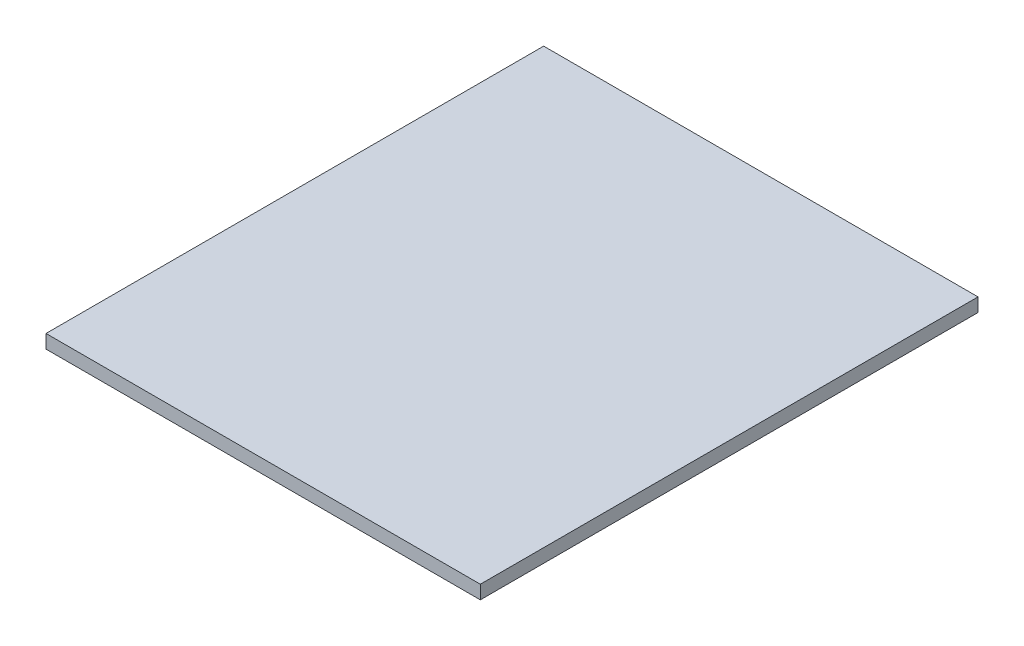
ISO-10303-21;
HEADER;
FILE_DESCRIPTION(('STEP AP214'),'2;1');
FILE_NAME('part.step','',(''),(''),'','','');
FILE_SCHEMA(('AUTOMOTIVE_DESIGN { 1 0 10303 214 1 1 1 1 }'));
ENDSEC;
DATA;
#1=APPLICATION_CONTEXT('core data for automotive mechanical design processes');
#2=APPLICATION_PROTOCOL_DEFINITION('international standard','automotive_design',2000,#1);
#3=PRODUCT_CONTEXT('',#1,'mechanical');
#4=PRODUCT('Part','Part','',(#3));
#5=PRODUCT_RELATED_PRODUCT_CATEGORY('part','',(#4));
#6=PRODUCT_DEFINITION_FORMATION('','',#4);
#7=PRODUCT_DEFINITION_CONTEXT('part definition',#1,'design');
#8=PRODUCT_DEFINITION('design','',#6,#7);
#9=PRODUCT_DEFINITION_SHAPE('','',#8);
#10=(LENGTH_UNIT() NAMED_UNIT(*) SI_UNIT(.MILLI.,.METRE.));
#11=(NAMED_UNIT(*) PLANE_ANGLE_UNIT() SI_UNIT($,.RADIAN.));
#12=(NAMED_UNIT(*) SI_UNIT($,.STERADIAN.) SOLID_ANGLE_UNIT());
#13=UNCERTAINTY_MEASURE_WITH_UNIT(LENGTH_MEASURE(1.E-05),#10,'distance_accuracy_value','');
#14=(GEOMETRIC_REPRESENTATION_CONTEXT(3) GLOBAL_UNCERTAINTY_ASSIGNED_CONTEXT((#13)) GLOBAL_UNIT_ASSIGNED_CONTEXT((#10,
#11,#12)) REPRESENTATION_CONTEXT('',''));
#15=CARTESIAN_POINT('',(0.,0.,0.));
#16=DIRECTION('',(0.,0.,1.));
#17=DIRECTION('',(1.,0.,0.));
#18=AXIS2_PLACEMENT_3D('',#15,#16,#17);
#19=CARTESIAN_POINT('',(0.,6.,0.));
#20=DIRECTION('',(1.,0.,0.));
#21=DIRECTION('',(0.,0.,-1.));
#22=AXIS2_PLACEMENT_3D('',#19,#20,#21);
#23=PLANE('',#22);
#24=DIRECTION('',(0.,0.,1.));
#25=VECTOR('',#24,1.);
#26=CARTESIAN_POINT('',(0.,0.,0.));
#27=LINE('',#26,#25);
#28=CARTESIAN_POINT('',(0.,0.,-220.));
#29=VERTEX_POINT('',#28);
#30=CARTESIAN_POINT('',(0.,0.,0.));
#31=VERTEX_POINT('',#30);
#32=EDGE_CURVE('E97',#29,#31,#27,.T.);
#33=ORIENTED_EDGE('',*,*,#32,.T.);
#34=DIRECTION('',(0.,-1.,0.));
#35=VECTOR('',#34,1.);
#36=CARTESIAN_POINT('',(0.,6.,0.));
#37=LINE('',#36,#35);
#38=CARTESIAN_POINT('',(0.,6.,0.));
#39=VERTEX_POINT('',#38);
#40=EDGE_CURVE('E11',#39,#31,#37,.T.);
#41=ORIENTED_EDGE('',*,*,#40,.F.);
#42=DIRECTION('',(0.,0.,1.));
#43=VECTOR('',#42,1.);
#44=CARTESIAN_POINT('',(0.,6.,0.));
#45=LINE('',#44,#43);
#46=CARTESIAN_POINT('',(0.,6.,-220.));
#47=VERTEX_POINT('',#46);
#48=EDGE_CURVE('E85',#47,#39,#45,.T.);
#49=ORIENTED_EDGE('',*,*,#48,.F.);
#50=DIRECTION('',(0.,-1.,0.));
#51=VECTOR('',#50,1.);
#52=CARTESIAN_POINT('',(0.,6.,-220.));
#53=LINE('',#52,#51);
#54=EDGE_CURVE('E93',#47,#29,#53,.T.);
#55=ORIENTED_EDGE('',*,*,#54,.T.);
#56=EDGE_LOOP('',(#33,#41,#49,#55));
#57=FACE_BOUND('',#56,.T.);
#58=ADVANCED_FACE('F34',(#57),#23,.F.);
#59=CARTESIAN_POINT('',(0.,6.,0.));
#60=DIRECTION('',(0.,0.,-1.));
#61=DIRECTION('',(-1.,0.,0.));
#62=AXIS2_PLACEMENT_3D('',#59,#60,#61);
#63=PLANE('',#62);
#64=DIRECTION('',(1.,0.,0.));
#65=VECTOR('',#64,1.);
#66=CARTESIAN_POINT('',(0.,0.,0.));
#67=LINE('',#66,#65);
#68=CARTESIAN_POINT('',(192.,0.,0.));
#69=VERTEX_POINT('',#68);
#70=EDGE_CURVE('E89',#31,#69,#67,.T.);
#71=ORIENTED_EDGE('',*,*,#70,.T.);
#72=DIRECTION('',(0.,-1.,0.));
#73=VECTOR('',#72,1.);
#74=CARTESIAN_POINT('',(192.,6.,0.));
#75=LINE('',#74,#73);
#76=CARTESIAN_POINT('',(192.,6.,0.));
#77=VERTEX_POINT('',#76);
#78=EDGE_CURVE('E42',#77,#69,#75,.T.);
#79=ORIENTED_EDGE('',*,*,#78,.F.);
#80=DIRECTION('',(1.,0.,0.));
#81=VECTOR('',#80,1.);
#82=CARTESIAN_POINT('',(0.,6.,0.));
#83=LINE('',#82,#81);
#84=EDGE_CURVE('E80',#39,#77,#83,.T.);
#85=ORIENTED_EDGE('',*,*,#84,.F.);
#86=ORIENTED_EDGE('',*,*,#40,.T.);
#87=EDGE_LOOP('',(#71,#79,#85,#86));
#88=FACE_BOUND('',#87,.T.);
#89=ADVANCED_FACE('F88',(#88),#63,.F.);
#90=CARTESIAN_POINT('',(192.,6.,0.));
#91=DIRECTION('',(-1.,0.,0.));
#92=DIRECTION('',(0.,0.,1.));
#93=AXIS2_PLACEMENT_3D('',#90,#91,#92);
#94=PLANE('',#93);
#95=DIRECTION('',(0.,0.,-1.));
#96=VECTOR('',#95,1.);
#97=CARTESIAN_POINT('',(192.,0.,0.));
#98=LINE('',#97,#96);
#99=CARTESIAN_POINT('',(192.,0.,-220.));
#100=VERTEX_POINT('',#99);
#101=EDGE_CURVE('E67',#69,#100,#98,.T.);
#102=ORIENTED_EDGE('',*,*,#101,.T.);
#103=DIRECTION('',(0.,-1.,0.));
#104=VECTOR('',#103,1.);
#105=CARTESIAN_POINT('',(192.,6.,-220.));
#106=LINE('',#105,#104);
#107=CARTESIAN_POINT('',(192.,6.,-220.));
#108=VERTEX_POINT('',#107);
#109=EDGE_CURVE('E90',#108,#100,#106,.T.);
#110=ORIENTED_EDGE('',*,*,#109,.F.);
#111=DIRECTION('',(0.,0.,-1.));
#112=VECTOR('',#111,1.);
#113=CARTESIAN_POINT('',(192.,6.,0.));
#114=LINE('',#113,#112);
#115=EDGE_CURVE('E83',#77,#108,#114,.T.);
#116=ORIENTED_EDGE('',*,*,#115,.F.);
#117=ORIENTED_EDGE('',*,*,#78,.T.);
#118=EDGE_LOOP('',(#102,#110,#116,#117));
#119=FACE_BOUND('',#118,.T.);
#120=ADVANCED_FACE('F91',(#119),#94,.F.);
#121=CARTESIAN_POINT('',(0.,6.,-220.));
#122=DIRECTION('',(0.,0.,1.));
#123=DIRECTION('',(1.,0.,0.));
#124=AXIS2_PLACEMENT_3D('',#121,#122,#123);
#125=PLANE('',#124);
#126=DIRECTION('',(-1.,0.,0.));
#127=VECTOR('',#126,1.);
#128=CARTESIAN_POINT('',(0.,0.,-220.));
#129=LINE('',#128,#127);
#130=EDGE_CURVE('E73',#100,#29,#129,.T.);
#131=ORIENTED_EDGE('',*,*,#130,.T.);
#132=ORIENTED_EDGE('',*,*,#54,.F.);
#133=DIRECTION('',(-1.,0.,0.));
#134=VECTOR('',#133,1.);
#135=CARTESIAN_POINT('',(0.,6.,-220.));
#136=LINE('',#135,#134);
#137=EDGE_CURVE('E50',#108,#47,#136,.T.);
#138=ORIENTED_EDGE('',*,*,#137,.F.);
#139=ORIENTED_EDGE('',*,*,#109,.T.);
#140=EDGE_LOOP('',(#131,#132,#138,#139));
#141=FACE_BOUND('',#140,.T.);
#142=ADVANCED_FACE('F104',(#141),#125,.F.);
#143=CARTESIAN_POINT('',(0.,6.,0.));
#144=DIRECTION('',(0.,-1.,0.));
#145=DIRECTION('',(0.,0.,-1.));
#146=AXIS2_PLACEMENT_3D('',#143,#144,#145);
#147=PLANE('',#146);
#148=ORIENTED_EDGE('',*,*,#48,.T.);
#149=ORIENTED_EDGE('',*,*,#84,.T.);
#150=ORIENTED_EDGE('',*,*,#115,.T.);
#151=ORIENTED_EDGE('',*,*,#137,.T.);
#152=EDGE_LOOP('',(#148,#149,#150,#151));
#153=FACE_BOUND('',#152,.T.);
#154=ADVANCED_FACE('F81',(#153),#147,.F.);
#155=CARTESIAN_POINT('',(0.,0.,0.));
#156=DIRECTION('',(0.,-1.,0.));
#157=DIRECTION('',(0.,0.,-1.));
#158=AXIS2_PLACEMENT_3D('',#155,#156,#157);
#159=PLANE('',#158);
#160=ORIENTED_EDGE('',*,*,#32,.F.);
#161=ORIENTED_EDGE('',*,*,#130,.F.);
#162=ORIENTED_EDGE('',*,*,#101,.F.);
#163=ORIENTED_EDGE('',*,*,#70,.F.);
#164=EDGE_LOOP('',(#160,#161,#162,#163));
#165=FACE_BOUND('',#164,.T.);
#166=ADVANCED_FACE('F107',(#165),#159,.T.);
#167=CLOSED_SHELL('',(#58,#89,#120,#142,#154,#166));
#168=MANIFOLD_SOLID_BREP('B2',#167);
#169=ADVANCED_BREP_SHAPE_REPRESENTATION('',(#18,#168),#14);
#170=SHAPE_DEFINITION_REPRESENTATION(#9,#169);
ENDSEC;
END-ISO-10303-21;
